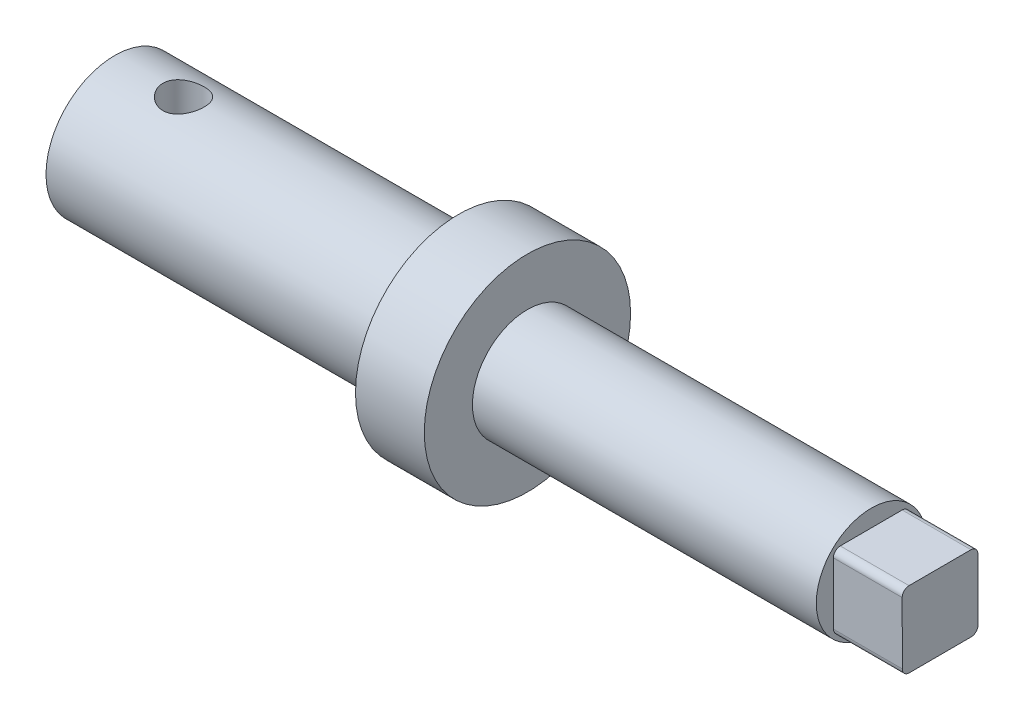
ISO-10303-21;
HEADER;
FILE_DESCRIPTION(('STEP AP214'),'2;1');
FILE_NAME('part.step','',(''),(''),'','','');
FILE_SCHEMA(('AUTOMOTIVE_DESIGN { 1 0 10303 214 1 1 1 1 }'));
ENDSEC;
DATA;
#1=APPLICATION_CONTEXT('core data for automotive mechanical design processes');
#2=APPLICATION_PROTOCOL_DEFINITION('international standard','automotive_design',2000,#1);
#3=PRODUCT_CONTEXT('',#1,'mechanical');
#4=PRODUCT('Part','Part','',(#3));
#5=PRODUCT_RELATED_PRODUCT_CATEGORY('part','',(#4));
#6=PRODUCT_DEFINITION_FORMATION('','',#4);
#7=PRODUCT_DEFINITION_CONTEXT('part definition',#1,'design');
#8=PRODUCT_DEFINITION('design','',#6,#7);
#9=PRODUCT_DEFINITION_SHAPE('','',#8);
#10=(LENGTH_UNIT() NAMED_UNIT(*) SI_UNIT(.MILLI.,.METRE.));
#11=(NAMED_UNIT(*) PLANE_ANGLE_UNIT() SI_UNIT($,.RADIAN.));
#12=(NAMED_UNIT(*) SI_UNIT($,.STERADIAN.) SOLID_ANGLE_UNIT());
#13=UNCERTAINTY_MEASURE_WITH_UNIT(LENGTH_MEASURE(1.E-05),#10,'distance_accuracy_value','');
#14=(GEOMETRIC_REPRESENTATION_CONTEXT(3) GLOBAL_UNCERTAINTY_ASSIGNED_CONTEXT((#13)) GLOBAL_UNIT_ASSIGNED_CONTEXT((#10,
#11,#12)) REPRESENTATION_CONTEXT('',''));
#15=CARTESIAN_POINT('',(0.,0.,0.));
#16=DIRECTION('',(0.,0.,1.));
#17=DIRECTION('',(1.,0.,0.));
#18=AXIS2_PLACEMENT_3D('',#15,#16,#17);
#19=CARTESIAN_POINT('',(55.,4.,0.));
#20=DIRECTION('',(-1.,0.,0.));
#21=DIRECTION('',(0.,0.,1.));
#22=AXIS2_PLACEMENT_3D('',#19,#20,#21);
#23=PLANE('',#22);
#24=CARTESIAN_POINT('',(55.,0.,0.));
#25=DIRECTION('',(-1.,0.,0.));
#26=DIRECTION('',(0.,0.,1.));
#27=AXIS2_PLACEMENT_3D('',#24,#25,#26);
#28=CIRCLE('',#27,4.);
#29=CARTESIAN_POINT('',(55.,0.,4.));
#30=VERTEX_POINT('',#29);
#31=EDGE_CURVE('E133',#30,#30,#28,.T.);
#32=ORIENTED_EDGE('',*,*,#31,.F.);
#33=EDGE_LOOP('',(#32));
#34=FACE_BOUND('',#33,.T.);
#35=DIRECTION('',(0.,-0.00265765345852937,0.999996468432811));
#36=VECTOR('',#35,1.);
#37=CARTESIAN_POINT('',(55.,2.75730857282167,-2.74269142717833));
#38=LINE('',#37,#36);
#39=CARTESIAN_POINT('',(55.,2.75597974609241,-2.24269319296192));
#40=VERTEX_POINT('',#39);
#41=CARTESIAN_POINT('',(55.,2.74402025390759,2.25731033860527));
#42=VERTEX_POINT('',#41);
#43=EDGE_CURVE('E115',#40,#42,#38,.T.);
#44=ORIENTED_EDGE('',*,*,#43,.F.);
#45=CARTESIAN_POINT('',(55.,2.255981511876,-2.24402201969119));
#46=DIRECTION('',(-1.,0.,0.));
#47=DIRECTION('',(0.,0.,1.));
#48=AXIS2_PLACEMENT_3D('',#45,#46,#47);
#49=CIRCLE('',#48,0.5);
#50=CARTESIAN_POINT('',(55.,2.25731033860527,-2.74402025390759));
#51=VERTEX_POINT('',#50);
#52=EDGE_CURVE('E99',#40,#51,#49,.T.);
#53=ORIENTED_EDGE('',*,*,#52,.T.);
#54=DIRECTION('',(0.,0.999996468432811,0.00265765345852969));
#55=VECTOR('',#54,1.);
#56=CARTESIAN_POINT('',(55.,-2.74269142717833,-2.75730857282167));
#57=LINE('',#56,#55);
#58=CARTESIAN_POINT('',(55.,-2.24269319296192,-2.75597974609241));
#59=VERTEX_POINT('',#58);
#60=EDGE_CURVE('E131',#59,#51,#57,.T.);
#61=ORIENTED_EDGE('',*,*,#60,.F.);
#62=CARTESIAN_POINT('',(55.,-2.24402201969119,-2.255981511876));
#63=DIRECTION('',(-1.,0.,0.));
#64=DIRECTION('',(0.,0.,1.));
#65=AXIS2_PLACEMENT_3D('',#62,#63,#64);
#66=CIRCLE('',#65,0.5);
#67=CARTESIAN_POINT('',(55.,-2.74402025390759,-2.25731033860527));
#68=VERTEX_POINT('',#67);
#69=EDGE_CURVE('E108',#59,#68,#66,.T.);
#70=ORIENTED_EDGE('',*,*,#69,.T.);
#71=DIRECTION('',(0.,0.00265765345852929,-0.999996468432811));
#72=VECTOR('',#71,1.);
#73=CARTESIAN_POINT('',(55.,-2.75730857282167,2.74269142717833));
#74=LINE('',#73,#72);
#75=CARTESIAN_POINT('',(55.,-2.75597974609241,2.24269319296192));
#76=VERTEX_POINT('',#75);
#77=EDGE_CURVE('E123',#76,#68,#74,.T.);
#78=ORIENTED_EDGE('',*,*,#77,.F.);
#79=CARTESIAN_POINT('',(55.,-2.255981511876,2.24402201969119));
#80=DIRECTION('',(-1.,0.,0.));
#81=DIRECTION('',(0.,0.,1.));
#82=AXIS2_PLACEMENT_3D('',#79,#80,#81);
#83=CIRCLE('',#82,0.5);
#84=CARTESIAN_POINT('',(55.,-2.25731033860527,2.74402025390759));
#85=VERTEX_POINT('',#84);
#86=EDGE_CURVE('E43',#76,#85,#83,.T.);
#87=ORIENTED_EDGE('',*,*,#86,.T.);
#88=DIRECTION('',(0.,-0.999996468432811,-0.00265765345852969));
#89=VECTOR('',#88,1.);
#90=CARTESIAN_POINT('',(55.,2.74269142717833,2.75730857282167));
#91=LINE('',#90,#89);
#92=CARTESIAN_POINT('',(55.,2.24269319296192,2.75597974609241));
#93=VERTEX_POINT('',#92);
#94=EDGE_CURVE('E121',#93,#85,#91,.T.);
#95=ORIENTED_EDGE('',*,*,#94,.F.);
#96=CARTESIAN_POINT('',(55.,2.24402201969119,2.255981511876));
#97=DIRECTION('',(-1.,0.,0.));
#98=DIRECTION('',(0.,0.,1.));
#99=AXIS2_PLACEMENT_3D('',#96,#97,#98);
#100=CIRCLE('',#99,0.5);
#101=EDGE_CURVE('E11',#93,#42,#100,.T.);
#102=ORIENTED_EDGE('',*,*,#101,.T.);
#103=EDGE_LOOP('',(#44,#53,#61,#70,#78,#87,#95,#102));
#104=FACE_BOUND('',#103,.T.);
#105=ADVANCED_FACE('F35',(#34,#104),#23,.F.);
#106=CARTESIAN_POINT('',(0.,0.,0.));
#107=DIRECTION('',(1.,0.,0.));
#108=DIRECTION('',(0.,0.,-1.));
#109=AXIS2_PLACEMENT_3D('',#106,#107,#108);
#110=PLANE('',#109);
#111=CARTESIAN_POINT('',(0.,0.,0.));
#112=DIRECTION('',(-1.,0.,0.));
#113=DIRECTION('',(0.,0.,1.));
#114=AXIS2_PLACEMENT_3D('',#111,#112,#113);
#115=CIRCLE('',#114,5.);
#116=CARTESIAN_POINT('',(0.,0.,5.));
#117=VERTEX_POINT('',#116);
#118=EDGE_CURVE('E148',#117,#117,#115,.T.);
#119=ORIENTED_EDGE('',*,*,#118,.T.);
#120=EDGE_LOOP('',(#119));
#121=FACE_BOUND('',#120,.T.);
#122=ADVANCED_FACE('F177',(#121),#110,.F.);
#123=CARTESIAN_POINT('',(0.,0.,0.));
#124=DIRECTION('',(-1.,0.,0.));
#125=DIRECTION('',(0.,0.,1.));
#126=AXIS2_PLACEMENT_3D('',#123,#124,#125);
#127=CYLINDRICAL_SURFACE('',#126,5.);
#128=CARTESIAN_POINT('',(3.5,-5.,0.));
#129=CARTESIAN_POINT('',(3.50000099748489,-4.9999992925055,0.0822886127533));
#130=CARTESIAN_POINT('',(3.50679386362397,-4.99794915693954,0.16458731835153));
#131=CARTESIAN_POINT('',(3.5337213542221,-4.98997105593691,0.326788125304881));
#132=CARTESIAN_POINT('',(3.55385995802334,-4.98404193389692,0.40668950441142));
#133=CARTESIAN_POINT('',(3.60674601691026,-4.96895552501836,0.561732707754527));
#134=CARTESIAN_POINT('',(3.63947486961894,-4.95980300250425,0.636881364395373));
#135=CARTESIAN_POINT('',(3.71653609305584,-4.93922109237645,0.780624181053132));
#136=CARTESIAN_POINT('',(3.76087000739542,-4.92779140192067,0.84921746746967));
#137=CARTESIAN_POINT('',(3.86122400747267,-4.90350737192774,0.979871797183745));
#138=CARTESIAN_POINT('',(3.91751662588591,-4.89062383657036,1.04171807124434));
#139=CARTESIAN_POINT('',(4.03960922991018,-4.86505834210442,1.15524920923324));
#140=CARTESIAN_POINT('',(4.10541081212496,-4.85237641724501,1.20693236327441));
#141=CARTESIAN_POINT('',(4.24647075303761,-4.82834113993772,1.29980037723708));
#142=CARTESIAN_POINT('',(4.32190846099074,-4.81702406663875,1.34072309022213));
#143=CARTESIAN_POINT('',(4.47898925423029,-4.79743620394031,1.4092139477476));
#144=CARTESIAN_POINT('',(4.56063084392798,-4.78916468313311,1.43678529919973));
#145=CARTESIAN_POINT('',(4.72539026613046,-4.77690870838434,1.47701633682652));
#146=CARTESIAN_POINT('',(4.80840274386394,-4.77281069324533,1.49007196234677));
#147=CARTESIAN_POINT('',(4.97553315621677,-4.76902789749767,1.50213730614672));
#148=CARTESIAN_POINT('',(5.05965081805909,-4.76934204760571,1.50115042761078));
#149=CARTESIAN_POINT('',(5.22338390860848,-4.77424744067778,1.48546977199812));
#150=CARTESIAN_POINT('',(5.30305225036224,-4.7786838859914,1.47127205262685));
#151=CARTESIAN_POINT('',(5.45881978627346,-4.79108356228624,1.43037420427056));
#152=CARTESIAN_POINT('',(5.53491862737433,-4.79904714132351,1.40367284141641));
#153=CARTESIAN_POINT('',(5.68260034966074,-4.81772733074973,1.33816026653682));
#154=CARTESIAN_POINT('',(5.75410708395526,-4.82848016115952,1.29918816934642));
#155=CARTESIAN_POINT('',(5.88973202201019,-4.85150987000065,1.21035222588683));
#156=CARTESIAN_POINT('',(5.95384842941378,-4.86378711746991,1.16048574002588));
#157=CARTESIAN_POINT('',(6.07568619076202,-4.88911011297937,1.04881290765546));
#158=CARTESIAN_POINT('',(6.13302866402967,-4.90216654310498,0.986594907466972));
#159=CARTESIAN_POINT('',(6.23655398406425,-4.92712244063259,0.853263259313967));
#160=CARTESIAN_POINT('',(6.28273612841443,-4.9390218351841,0.782149051860888));
#161=CARTESIAN_POINT('',(6.36285992246473,-4.9604316006947,0.632355038342803));
#162=CARTESIAN_POINT('',(6.39671751624986,-4.96992543668314,0.553627749747951));
#163=CARTESIAN_POINT('',(6.45059959009963,-4.98533521832222,0.39124541560352));
#164=CARTESIAN_POINT('',(6.47062792853249,-4.99125216186999,0.307591751589582));
#165=CARTESIAN_POINT('',(6.4956521778994,-4.99868364643538,0.140952242668332));
#166=CARTESIAN_POINT('',(6.50116158580161,-5.0003485041779,0.0580500976011876));
#167=CARTESIAN_POINT('',(6.49843084428792,-4.9995292324176,-0.107499605823383));
#168=CARTESIAN_POINT('',(6.49019253034856,-4.99704565677756,-0.190147196690781));
#169=CARTESIAN_POINT('',(6.46061538888851,-4.98830696987163,-0.350903605309697));
#170=CARTESIAN_POINT('',(6.43957661241913,-4.98213829799417,-0.429072772614169));
#171=CARTESIAN_POINT('',(6.3853567672218,-4.96674347841533,-0.580754638954522));
#172=CARTESIAN_POINT('',(6.35217423896214,-4.95751696321085,-0.654266777025584));
#173=CARTESIAN_POINT('',(6.27374683451887,-4.93669654351325,-0.796437189461053));
#174=CARTESIAN_POINT('',(6.22824065905203,-4.92505280829675,-0.86494382619967));
#175=CARTESIAN_POINT('',(6.12677524594719,-4.90073468764318,-0.993523307980148));
#176=CARTESIAN_POINT('',(6.07081338811233,-4.8880600443108,-1.05359403235594));
#177=CARTESIAN_POINT('',(5.94761269163066,-4.86253171869138,-1.16585744551027));
#178=CARTESIAN_POINT('',(5.88003812422826,-4.84968825033268,-1.21768481231503));
#179=CARTESIAN_POINT('',(5.73687206098647,-4.82576515238463,-1.30928995072154));
#180=CARTESIAN_POINT('',(5.66128077544179,-4.81468547654651,-1.34906803829472));
#181=CARTESIAN_POINT('',(5.50446750874531,-4.79567189615055,-1.41517347127168));
#182=CARTESIAN_POINT('',(5.42327381346341,-4.78772337843827,-1.4415634693705));
#183=CARTESIAN_POINT('',(5.25731203106852,-4.77591594362794,-1.48021730815114));
#184=CARTESIAN_POINT('',(5.17254517921233,-4.772055625083,-1.49248598978779));
#185=CARTESIAN_POINT('',(5.00563848162377,-4.76899972496087,-1.50221984485059));
#186=CARTESIAN_POINT('',(4.92353634898241,-4.76961647442754,-1.5002805530849));
#187=CARTESIAN_POINT('',(4.7608858966272,-4.77499401288294,-1.48307505444813));
#188=CARTESIAN_POINT('',(4.68033751482365,-4.77975463592551,-1.46780938124716));
#189=CARTESIAN_POINT('',(4.52405460085715,-4.79275763670386,-1.42476888804136));
#190=CARTESIAN_POINT('',(4.44827271263831,-4.80095604545965,-1.39715175507068));
#191=CARTESIAN_POINT('',(4.30235756118228,-4.81990278909136,-1.33031507121129));
#192=CARTESIAN_POINT('',(4.23222538235924,-4.83065161194312,-1.29109329962876));
#193=CARTESIAN_POINT('',(4.09683688347289,-4.85397676425833,-1.20048763805072));
#194=CARTESIAN_POINT('',(4.03185123873959,-4.86660540163798,-1.14871276092994));
#195=CARTESIAN_POINT('',(3.91129750169214,-4.89201320450026,-1.03517434629782));
#196=CARTESIAN_POINT('',(3.85573186053224,-4.90479240823905,-0.973408217134502));
#197=CARTESIAN_POINT('',(3.75397658770497,-4.92950936570649,-0.839465762183249));
#198=CARTESIAN_POINT('',(3.70810855314451,-4.94141159765674,-0.767037885790608));
#199=CARTESIAN_POINT('',(3.62926483009597,-4.96260680455813,-0.615141373983529));
#200=CARTESIAN_POINT('',(3.59628311172549,-4.97190099931067,-0.535676052998955));
#201=CARTESIAN_POINT('',(3.54710472434725,-4.98602174969301,-0.380757712655282));
#202=CARTESIAN_POINT('',(3.52948832711675,-4.99122027381068,-0.305786961954235));
#203=CARTESIAN_POINT('',(3.50593647475842,-4.99820944494492,-0.15388019523078));
#204=CARTESIAN_POINT('',(3.49999906729518,-5.0000006615474,-0.0769445098581397));
#205=CARTESIAN_POINT('',(3.5,-5.,0.));
#206=B_SPLINE_CURVE_WITH_KNOTS('',3,(#128,#129,#130,#131,#132,#133,#134,#135,#136,#137,#138,
#139,#140,#141,#142,#143,#144,#145,#146,#147,#148,#149,#150,#151,#152,#153,#154,#155,#156,#157,
#158,#159,#160,#161,#162,#163,#164,#165,#166,#167,#168,#169,#170,#171,#172,#173,#174,#175,#176,
#177,#178,#179,#180,#181,#182,#183,#184,#185,#186,#187,#188,#189,#190,#191,#192,#193,#194,#195,
#196,#197,#198,#199,#200,#201,#202,#203,#204,#205),.UNSPECIFIED.,.T.,.F.,(4,2,2,2,2,2,2,2,2,2,2,
2,2,2,2,2,2,2,2,2,2,2,2,2,2,2,2,2,2,2,2,2,2,2,2,2,2,2,4),(0.,0.246583203612611,0.493239964846,
0.739533676300875,0.985860164412702,1.23855602948192,1.49129437288633,1.74971481004109,
2.00807314543224,2.25919689356599,2.51025978319089,2.75226016697676,2.99428443658001,
3.2396242644712,3.48502360158556,3.74067104048167,3.99633456531072,4.25371046881689,
4.51101453528808,4.75908809438545,5.00712853550327,5.24956746682327,5.49203554593729,
5.74011305702908,5.98825282000191,6.24540400322818,6.50254844252681,6.75847814951252,
7.01432009460283,7.25950155466943,7.504673196616,7.74680040402721,7.98897397553107,
8.23996925679931,8.49102974897502,8.74942996156671,9.00770911595235,9.23831691930459,
9.46888616948874),.UNSPECIFIED.);
#207=CARTESIAN_POINT('',(3.5,-5.,0.));
#208=VERTEX_POINT('',#207);
#209=EDGE_CURVE('E158',#208,#208,#206,.T.);
#210=ORIENTED_EDGE('',*,*,#209,.T.);
#211=EDGE_LOOP('',(#210));
#212=FACE_BOUND('',#211,.T.);
#213=CARTESIAN_POINT('',(5.,4.76969600708473,1.5));
#214=CARTESIAN_POINT('',(4.9178054520576,4.7696968572698,1.49999897633764));
#215=CARTESIAN_POINT('',(4.83560077585598,4.77184390209069,1.49322108167142));
#216=CARTESIAN_POINT('',(4.67359475040806,4.780165783029,1.46635844446749));
#217=CARTESIAN_POINT('',(4.59379421349854,4.78634196493468,1.44626925573578));
#218=CARTESIAN_POINT('',(4.43896527172827,4.80196102485632,1.39352753269955));
#219=CARTESIAN_POINT('',(4.36392917036691,4.81139846703232,1.36089589394243));
#220=CARTESIAN_POINT('',(4.2203780660047,4.83246932547567,1.28406421917929));
#221=CARTESIAN_POINT('',(4.15186404131556,4.84410307041019,1.23986245137053));
#222=CARTESIAN_POINT('',(4.02113360942262,4.86866862185765,1.13964754141627));
#223=CARTESIAN_POINT('',(3.95915410205371,4.88162808311636,1.08333207175807));
#224=CARTESIAN_POINT('',(3.84536204867749,4.90714861936757,0.961136237579599));
#225=CARTESIAN_POINT('',(3.79355080955012,4.91970964297705,0.895254645461112));
#226=CARTESIAN_POINT('',(3.70053730016669,4.94333214579389,0.75411143779369));
#227=CARTESIAN_POINT('',(3.65957657555719,4.95435724342404,0.678684021335815));
#228=CARTESIAN_POINT('',(3.59101274095724,4.97334435920684,0.521624645369354));
#229=CARTESIAN_POINT('',(3.56340675014255,4.98130703789495,0.439994028387912));
#230=CARTESIAN_POINT('',(3.52311999890949,4.99307646003589,0.275323852630829));
#231=CARTESIAN_POINT('',(3.5100348723473,4.99699557369338,0.192391398953801));
#232=CARTESIAN_POINT('',(3.49788267535356,5.00063201501348,0.0254218237493149));
#233=CARTESIAN_POINT('',(3.49881266059804,5.00035022521079,-0.0586150620503684));
#234=CARTESIAN_POINT('',(3.51439286854302,4.99569603817659,-0.22257115660016));
#235=CARTESIAN_POINT('',(3.52860519380987,4.9914542020526,-0.302536267641342));
#236=CARTESIAN_POINT('',(3.56963133599429,4.97951522112593,-0.458889213442527));
#237=CARTESIAN_POINT('',(3.59644595094267,4.97181785750586,-0.535276821322846));
#238=CARTESIAN_POINT('',(3.66221202341856,4.95365220986963,-0.683347326351281));
#239=CARTESIAN_POINT('',(3.70130120280727,4.94315269676706,-0.754965064694478));
#240=CARTESIAN_POINT('',(3.79039785242823,4.92049640648069,-0.890764673783156));
#241=CARTESIAN_POINT('',(3.84040791296348,4.90833923637778,-0.954944774872131));
#242=CARTESIAN_POINT('',(3.9521977507516,4.88311550488165,-1.0766604815298));
#243=CARTESIAN_POINT('',(4.01435691902974,4.87003195321461,-1.13384458040112));
#244=CARTESIAN_POINT('',(4.14751001789005,4.84483979887497,-1.23707651539824));
#245=CARTESIAN_POINT('',(4.21850482538923,4.8327312931702,-1.28312324482853));
#246=CARTESIAN_POINT('',(4.36823946924899,4.81077903197678,-1.3631399533545));
#247=CARTESIAN_POINT('',(4.44704704586292,4.80095810695957,-1.39698989237679));
#248=CARTESIAN_POINT('',(4.60960720844554,4.78496392548436,-1.45083362878413));
#249=CARTESIAN_POINT('',(4.69335817153456,4.7787894791583,-1.4708319464056));
#250=CARTESIAN_POINT('',(4.86008236073928,4.77104849541241,-1.49574770282165));
#251=CARTESIAN_POINT('',(4.94296822389398,4.7693187867044,-1.50119946380212));
#252=CARTESIAN_POINT('',(5.10847290000987,4.77021192441924,-1.49835947233062));
#253=CARTESIAN_POINT('',(5.19109174873085,4.77283416156589,-1.4900696437133));
#254=CARTESIAN_POINT('',(5.35148837797087,4.78197558554912,-1.4604576357419));
#255=CARTESIAN_POINT('',(5.42933616426352,4.78839176507489,-1.4394796143128));
#256=CARTESIAN_POINT('',(5.58040169081492,4.80429141231227,-1.3854857774794));
#257=CARTESIAN_POINT('',(5.65361871414057,4.81377535359073,-1.3524681034276));
#258=CARTESIAN_POINT('',(5.79551746407213,4.83505835023047,-1.274318711965));
#259=CARTESIAN_POINT('',(5.86402472098579,4.84691271069799,-1.22888564172729));
#260=CARTESIAN_POINT('',(5.9926381061808,4.87148205646987,-1.12755301600385));
#261=CARTESIAN_POINT('',(6.05274221761279,4.88419724730003,-1.07165095534897));
#262=CARTESIAN_POINT('',(6.16518040581474,4.90963633548158,-0.948455132493599));
#263=CARTESIAN_POINT('',(6.21713562898698,4.92234245063004,-0.880811065857435));
#264=CARTESIAN_POINT('',(6.30896670102775,4.94584851748651,-0.737461784590249));
#265=CARTESIAN_POINT('',(6.34884314978146,4.95664856384717,-0.661756970543944));
#266=CARTESIAN_POINT('',(6.4150000305683,4.97505970474957,-0.504935504705222));
#267=CARTESIAN_POINT('',(6.44138201615898,4.98269453424966,-0.423864622037839));
#268=CARTESIAN_POINT('',(6.48006091889042,4.99401979596827,-0.258169966504589));
#269=CARTESIAN_POINT('',(6.49236186594842,4.9977113567088,-0.173547217354763));
#270=CARTESIAN_POINT('',(6.5022230440545,5.00066544081399,-0.00665215388274325));
#271=CARTESIAN_POINT('',(6.50033269540783,5.00009305111322,0.0755851790862062));
#272=CARTESIAN_POINT('',(6.48317836750088,4.99497264465037,0.238519481164403));
#273=CARTESIAN_POINT('',(6.46791514651956,4.99042485330463,0.319216537346528));
#274=CARTESIAN_POINT('',(6.42478833860038,4.97791168358327,0.475935813041358));
#275=CARTESIAN_POINT('',(6.39706181935099,4.96998352900866,0.551998927351392));
#276=CARTESIAN_POINT('',(6.32991808549281,4.9515294303945,0.698433237752053));
#277=CARTESIAN_POINT('',(6.29049894971381,4.94100305949946,0.76880349605058));
#278=CARTESIAN_POINT('',(6.19962654256996,4.91803965828228,0.904301892420563));
#279=CARTESIAN_POINT('',(6.14782856999923,4.90555226923559,0.969190250076768));
#280=CARTESIAN_POINT('',(6.0342896116672,4.88023537212334,1.08953757134595));
#281=CARTESIAN_POINT('',(5.97254576210185,4.86740576641079,1.14499380960194));
#282=CARTESIAN_POINT('',(5.83865922168949,4.84240680631319,1.24656269394549));
#283=CARTESIAN_POINT('',(5.76626144660956,4.83026852693485,1.29234759757956));
#284=CARTESIAN_POINT('',(5.61444482583898,4.80852547508793,1.37104313528776));
#285=CARTESIAN_POINT('',(5.53502937639881,4.79891948596955,1.40395995557289));
#286=CARTESIAN_POINT('',(5.38025956839373,4.78427816717595,1.4530194253295));
#287=CARTESIAN_POINT('',(5.30539135306901,4.7788615484052,1.47058859011232));
#288=CARTESIAN_POINT('',(5.15368477750423,4.77157042597167,1.49407818835144));
#289=CARTESIAN_POINT('',(5.07684681535475,4.7696952122143,1.50000095706095));
#290=CARTESIAN_POINT('',(5.,4.76969600708473,1.5));
#291=B_SPLINE_CURVE_WITH_KNOTS('',3,(#213,#214,#215,#216,#217,#218,#219,#220,#221,#222,#223,
#224,#225,#226,#227,#228,#229,#230,#231,#232,#233,#234,#235,#236,#237,#238,#239,#240,#241,#242,
#243,#244,#245,#246,#247,#248,#249,#250,#251,#252,#253,#254,#255,#256,#257,#258,#259,#260,#261,
#262,#263,#264,#265,#266,#267,#268,#269,#270,#271,#272,#273,#274,#275,#276,#277,#278,#279,#280,
#281,#282,#283,#284,#285,#286,#287,#288,#289,#290),.UNSPECIFIED.,.T.,.F.,(4,2,2,2,2,2,2,2,2,2,2,
2,2,2,2,2,2,2,2,2,2,2,2,2,2,2,2,2,2,2,2,2,2,2,2,2,2,2,4),(0.,0.246300165915543,0.492682641689,
0.738656414466193,0.984667025370101,1.23773150007984,1.49082847871273,1.74915939273645,
2.00743455587877,2.25832140149558,2.5091555410144,2.7520012599088,2.99486235890376,
3.24055209335676,3.48630016590831,3.74152147023278,3.99676812491863,4.25446238246267,
4.51207250628411,4.76008080790309,5.00805439107388,5.24958594938817,5.49115481045788,
5.73920731809389,5.98731925928923,6.24479506100602,6.50225807324202,6.75775391814325,
7.01317662321682,7.2587630391122,7.50433553047755,7.74727096872219,7.99024634491379,
8.24099627054489,8.49181852629891,8.75011639669147,9.00828993963945,9.23861153857448,
9.46888695033561),.UNSPECIFIED.);
#292=CARTESIAN_POINT('',(5.,4.76969600708473,1.5));
#293=VERTEX_POINT('',#292);
#294=EDGE_CURVE('E151',#293,#293,#291,.T.);
#295=ORIENTED_EDGE('',*,*,#294,.T.);
#296=EDGE_LOOP('',(#295));
#297=FACE_BOUND('',#296,.T.);
#298=ORIENTED_EDGE('',*,*,#118,.F.);
#299=EDGE_LOOP('',(#298));
#300=FACE_BOUND('',#299,.T.);
#301=CARTESIAN_POINT('',(25.,0.,0.));
#302=DIRECTION('',(-1.,0.,0.));
#303=DIRECTION('',(0.,0.,1.));
#304=AXIS2_PLACEMENT_3D('',#301,#302,#303);
#305=CIRCLE('',#304,5.);
#306=CARTESIAN_POINT('',(25.,0.,5.));
#307=VERTEX_POINT('',#306);
#308=EDGE_CURVE('E145',#307,#307,#305,.T.);
#309=ORIENTED_EDGE('',*,*,#308,.T.);
#310=EDGE_LOOP('',(#309));
#311=FACE_BOUND('',#310,.T.);
#312=ADVANCED_FACE('F162',(#212,#297,#300,#311),#127,.T.);
#313=CARTESIAN_POINT('',(25.,5.,0.));
#314=DIRECTION('',(1.,0.,0.));
#315=DIRECTION('',(0.,0.,-1.));
#316=AXIS2_PLACEMENT_3D('',#313,#314,#315);
#317=PLANE('',#316);
#318=ORIENTED_EDGE('',*,*,#308,.F.);
#319=EDGE_LOOP('',(#318));
#320=FACE_BOUND('',#319,.T.);
#321=CARTESIAN_POINT('',(25.,0.,0.));
#322=DIRECTION('',(-1.,0.,0.));
#323=DIRECTION('',(0.,0.,1.));
#324=AXIS2_PLACEMENT_3D('',#321,#322,#323);
#325=CIRCLE('',#324,7.5);
#326=CARTESIAN_POINT('',(25.,0.,7.5));
#327=VERTEX_POINT('',#326);
#328=EDGE_CURVE('E142',#327,#327,#325,.T.);
#329=ORIENTED_EDGE('',*,*,#328,.T.);
#330=EDGE_LOOP('',(#329));
#331=FACE_BOUND('',#330,.T.);
#332=ADVANCED_FACE('F188',(#320,#331),#317,.F.);
#333=CARTESIAN_POINT('',(0.,0.,0.));
#334=DIRECTION('',(-1.,0.,0.));
#335=DIRECTION('',(0.,0.,1.));
#336=AXIS2_PLACEMENT_3D('',#333,#334,#335);
#337=CYLINDRICAL_SURFACE('',#336,7.5);
#338=ORIENTED_EDGE('',*,*,#328,.F.);
#339=EDGE_LOOP('',(#338));
#340=FACE_BOUND('',#339,.T.);
#341=CARTESIAN_POINT('',(30.,0.,0.));
#342=DIRECTION('',(-1.,0.,0.));
#343=DIRECTION('',(0.,0.,1.));
#344=AXIS2_PLACEMENT_3D('',#341,#342,#343);
#345=CIRCLE('',#344,7.5);
#346=CARTESIAN_POINT('',(30.,0.,7.5));
#347=VERTEX_POINT('',#346);
#348=EDGE_CURVE('E139',#347,#347,#345,.T.);
#349=ORIENTED_EDGE('',*,*,#348,.T.);
#350=EDGE_LOOP('',(#349));
#351=FACE_BOUND('',#350,.T.);
#352=ADVANCED_FACE('F185',(#340,#351),#337,.T.);
#353=CARTESIAN_POINT('',(30.,7.5,0.));
#354=DIRECTION('',(-1.,0.,0.));
#355=DIRECTION('',(0.,0.,1.));
#356=AXIS2_PLACEMENT_3D('',#353,#354,#355);
#357=PLANE('',#356);
#358=ORIENTED_EDGE('',*,*,#348,.F.);
#359=EDGE_LOOP('',(#358));
#360=FACE_BOUND('',#359,.T.);
#361=CARTESIAN_POINT('',(30.,0.,0.));
#362=DIRECTION('',(-1.,0.,0.));
#363=DIRECTION('',(0.,0.,1.));
#364=AXIS2_PLACEMENT_3D('',#361,#362,#363);
#365=CIRCLE('',#364,4.);
#366=CARTESIAN_POINT('',(30.,0.,4.));
#367=VERTEX_POINT('',#366);
#368=EDGE_CURVE('E136',#367,#367,#365,.T.);
#369=ORIENTED_EDGE('',*,*,#368,.T.);
#370=EDGE_LOOP('',(#369));
#371=FACE_BOUND('',#370,.T.);
#372=ADVANCED_FACE('F181',(#360,#371),#357,.F.);
#373=CARTESIAN_POINT('',(0.,0.,0.));
#374=DIRECTION('',(-1.,0.,0.));
#375=DIRECTION('',(0.,0.,1.));
#376=AXIS2_PLACEMENT_3D('',#373,#374,#375);
#377=CYLINDRICAL_SURFACE('',#376,4.);
#378=ORIENTED_EDGE('',*,*,#368,.F.);
#379=EDGE_LOOP('',(#378));
#380=FACE_BOUND('',#379,.T.);
#381=ORIENTED_EDGE('',*,*,#31,.T.);
#382=EDGE_LOOP('',(#381));
#383=FACE_BOUND('',#382,.T.);
#384=ADVANCED_FACE('F171',(#380,#383),#377,.T.);
#385=CARTESIAN_POINT('',(5.,-5.,0.));
#386=DIRECTION('',(0.,1.,0.));
#387=DIRECTION('',(0.,0.,1.));
#388=AXIS2_PLACEMENT_3D('',#385,#386,#387);
#389=CYLINDRICAL_SURFACE('',#388,1.5);
#390=ORIENTED_EDGE('',*,*,#294,.F.);
#391=EDGE_LOOP('',(#390));
#392=FACE_BOUND('',#391,.T.);
#393=ORIENTED_EDGE('',*,*,#209,.F.);
#394=EDGE_LOOP('',(#393));
#395=FACE_BOUND('',#394,.T.);
#396=ADVANCED_FACE('F166',(#392,#395),#389,.F.);
#397=CARTESIAN_POINT('',(60.,2.75730857282167,-2.74269142717833));
#398=DIRECTION('',(0.,-0.999996468432811,-0.00265765345852937));
#399=DIRECTION('',(0.,0.00265765345852937,-0.999996468432811));
#400=AXIS2_PLACEMENT_3D('',#397,#398,#399);
#401=PLANE('',#400);
#402=DIRECTION('',(0.,-0.00265765345852937,0.999996468432811));
#403=VECTOR('',#402,1.);
#404=CARTESIAN_POINT('',(60.,2.75730857282167,-2.74269142717833));
#405=LINE('',#404,#403);
#406=CARTESIAN_POINT('',(60.,2.75597974609241,-2.24269319296192));
#407=VERTEX_POINT('',#406);
#408=CARTESIAN_POINT('',(60.,2.74402025390759,2.25731033860527));
#409=VERTEX_POINT('',#408);
#410=EDGE_CURVE('E117',#407,#409,#405,.T.);
#411=ORIENTED_EDGE('',*,*,#410,.F.);
#412=DIRECTION('',(-1.,0.,0.));
#413=VECTOR('',#412,1.);
#414=CARTESIAN_POINT('',(60.,2.75597974609241,-2.24269319296192));
#415=LINE('',#414,#413);
#416=EDGE_CURVE('E103',#407,#40,#415,.T.);
#417=ORIENTED_EDGE('',*,*,#416,.T.);
#418=ORIENTED_EDGE('',*,*,#43,.T.);
#419=DIRECTION('',(-1.,0.,0.));
#420=VECTOR('',#419,1.);
#421=CARTESIAN_POINT('',(60.,2.74402025390759,2.25731033860527));
#422=LINE('',#421,#420);
#423=EDGE_CURVE('E119',#42,#409,#422,.F.);
#424=ORIENTED_EDGE('',*,*,#423,.T.);
#425=EDGE_LOOP('',(#411,#417,#418,#424));
#426=FACE_BOUND('',#425,.T.);
#427=ADVANCED_FACE('F114',(#426),#401,.F.);
#428=CARTESIAN_POINT('',(60.,2.74269142717833,2.75730857282167));
#429=DIRECTION('',(0.,0.00265765345852969,-0.999996468432811));
#430=DIRECTION('',(0.,0.999996468432811,0.00265765345852969));
#431=AXIS2_PLACEMENT_3D('',#428,#429,#430);
#432=PLANE('',#431);
#433=ORIENTED_EDGE('',*,*,#94,.T.);
#434=DIRECTION('',(-1.,0.,0.));
#435=VECTOR('',#434,1.);
#436=CARTESIAN_POINT('',(60.,-2.25731033860527,2.74402025390759));
#437=LINE('',#436,#435);
#438=CARTESIAN_POINT('',(60.,-2.25731033860527,2.74402025390759));
#439=VERTEX_POINT('',#438);
#440=EDGE_CURVE('E109',#85,#439,#437,.F.);
#441=ORIENTED_EDGE('',*,*,#440,.T.);
#442=DIRECTION('',(0.,-0.999996468432811,-0.00265765345852969));
#443=VECTOR('',#442,1.);
#444=CARTESIAN_POINT('',(60.,2.74269142717833,2.75730857282167));
#445=LINE('',#444,#443);
#446=CARTESIAN_POINT('',(60.,2.24269319296192,2.75597974609241));
#447=VERTEX_POINT('',#446);
#448=EDGE_CURVE('E254',#447,#439,#445,.T.);
#449=ORIENTED_EDGE('',*,*,#448,.F.);
#450=DIRECTION('',(-1.,0.,0.));
#451=VECTOR('',#450,1.);
#452=CARTESIAN_POINT('',(60.,2.24269319296192,2.75597974609241));
#453=LINE('',#452,#451);
#454=EDGE_CURVE('E234',#447,#93,#453,.T.);
#455=ORIENTED_EDGE('',*,*,#454,.T.);
#456=EDGE_LOOP('',(#433,#441,#449,#455));
#457=FACE_BOUND('',#456,.T.);
#458=ADVANCED_FACE('F261',(#457),#432,.F.);
#459=CARTESIAN_POINT('',(60.,-2.75730857282167,2.74269142717833));
#460=DIRECTION('',(0.,0.999996468432811,0.00265765345852929));
#461=DIRECTION('',(0.,-0.00265765345852929,0.999996468432811));
#462=AXIS2_PLACEMENT_3D('',#459,#460,#461);
#463=PLANE('',#462);
#464=ORIENTED_EDGE('',*,*,#77,.T.);
#465=DIRECTION('',(-1.,0.,0.));
#466=VECTOR('',#465,1.);
#467=CARTESIAN_POINT('',(60.,-2.74402025390759,-2.25731033860527));
#468=LINE('',#467,#466);
#469=CARTESIAN_POINT('',(60.,-2.74402025390759,-2.25731033860527));
#470=VERTEX_POINT('',#469);
#471=EDGE_CURVE('E232',#68,#470,#468,.F.);
#472=ORIENTED_EDGE('',*,*,#471,.T.);
#473=DIRECTION('',(0.,0.00265765345852929,-0.999996468432811));
#474=VECTOR('',#473,1.);
#475=CARTESIAN_POINT('',(60.,-2.75730857282167,2.74269142717833));
#476=LINE('',#475,#474);
#477=CARTESIAN_POINT('',(60.,-2.75597974609241,2.24269319296192));
#478=VERTEX_POINT('',#477);
#479=EDGE_CURVE('E251',#478,#470,#476,.T.);
#480=ORIENTED_EDGE('',*,*,#479,.F.);
#481=DIRECTION('',(-1.,0.,0.));
#482=VECTOR('',#481,1.);
#483=CARTESIAN_POINT('',(60.,-2.75597974609241,2.24269319296192));
#484=LINE('',#483,#482);
#485=EDGE_CURVE('E229',#478,#76,#484,.T.);
#486=ORIENTED_EDGE('',*,*,#485,.T.);
#487=EDGE_LOOP('',(#464,#472,#480,#486));
#488=FACE_BOUND('',#487,.T.);
#489=ADVANCED_FACE('F241',(#488),#463,.F.);
#490=CARTESIAN_POINT('',(60.,-2.74269142717833,-2.75730857282167));
#491=DIRECTION('',(0.,-0.00265765345852969,0.999996468432811));
#492=DIRECTION('',(0.,-0.999996468432811,-0.00265765345852969));
#493=AXIS2_PLACEMENT_3D('',#490,#491,#492);
#494=PLANE('',#493);
#495=ORIENTED_EDGE('',*,*,#60,.T.);
#496=DIRECTION('',(-1.,0.,0.));
#497=VECTOR('',#496,1.);
#498=CARTESIAN_POINT('',(60.,2.25731033860527,-2.74402025390759));
#499=LINE('',#498,#497);
#500=CARTESIAN_POINT('',(60.,2.25731033860527,-2.74402025390759));
#501=VERTEX_POINT('',#500);
#502=EDGE_CURVE('E104',#51,#501,#499,.F.);
#503=ORIENTED_EDGE('',*,*,#502,.T.);
#504=DIRECTION('',(0.,0.999996468432811,0.00265765345852969));
#505=VECTOR('',#504,1.);
#506=CARTESIAN_POINT('',(60.,-2.74269142717833,-2.75730857282167));
#507=LINE('',#506,#505);
#508=CARTESIAN_POINT('',(60.,-2.24269319296192,-2.75597974609241));
#509=VERTEX_POINT('',#508);
#510=EDGE_CURVE('E126',#509,#501,#507,.T.);
#511=ORIENTED_EDGE('',*,*,#510,.F.);
#512=DIRECTION('',(-1.,0.,0.));
#513=VECTOR('',#512,1.);
#514=CARTESIAN_POINT('',(60.,-2.24269319296192,-2.75597974609241));
#515=LINE('',#514,#513);
#516=EDGE_CURVE('E118',#509,#59,#515,.T.);
#517=ORIENTED_EDGE('',*,*,#516,.T.);
#518=EDGE_LOOP('',(#495,#503,#511,#517));
#519=FACE_BOUND('',#518,.T.);
#520=ADVANCED_FACE('F253',(#519),#494,.F.);
#521=CARTESIAN_POINT('',(60.,0.,0.));
#522=DIRECTION('',(1.,0.,0.));
#523=DIRECTION('',(0.,0.,-1.));
#524=AXIS2_PLACEMENT_3D('',#521,#522,#523);
#525=PLANE('',#524);
#526=ORIENTED_EDGE('',*,*,#510,.T.);
#527=CARTESIAN_POINT('',(60.,2.255981511876,-2.24402201969119));
#528=DIRECTION('',(1.,0.,0.));
#529=DIRECTION('',(0.,0.,-1.));
#530=AXIS2_PLACEMENT_3D('',#527,#528,#529);
#531=CIRCLE('',#530,0.5);
#532=EDGE_CURVE('E227',#501,#407,#531,.T.);
#533=ORIENTED_EDGE('',*,*,#532,.T.);
#534=ORIENTED_EDGE('',*,*,#410,.T.);
#535=CARTESIAN_POINT('',(60.,2.24402201969119,2.255981511876));
#536=DIRECTION('',(1.,0.,0.));
#537=DIRECTION('',(0.,0.,-1.));
#538=AXIS2_PLACEMENT_3D('',#535,#536,#537);
#539=CIRCLE('',#538,0.5);
#540=EDGE_CURVE('E221',#409,#447,#539,.T.);
#541=ORIENTED_EDGE('',*,*,#540,.T.);
#542=ORIENTED_EDGE('',*,*,#448,.T.);
#543=CARTESIAN_POINT('',(60.,-2.255981511876,2.24402201969119));
#544=DIRECTION('',(1.,0.,0.));
#545=DIRECTION('',(0.,0.,-1.));
#546=AXIS2_PLACEMENT_3D('',#543,#544,#545);
#547=CIRCLE('',#546,0.5);
#548=EDGE_CURVE('E223',#439,#478,#547,.T.);
#549=ORIENTED_EDGE('',*,*,#548,.T.);
#550=ORIENTED_EDGE('',*,*,#479,.T.);
#551=CARTESIAN_POINT('',(60.,-2.24402201969119,-2.255981511876));
#552=DIRECTION('',(1.,0.,0.));
#553=DIRECTION('',(0.,0.,-1.));
#554=AXIS2_PLACEMENT_3D('',#551,#552,#553);
#555=CIRCLE('',#554,0.5);
#556=EDGE_CURVE('E225',#470,#509,#555,.T.);
#557=ORIENTED_EDGE('',*,*,#556,.T.);
#558=EDGE_LOOP('',(#526,#533,#534,#541,#542,#549,#550,#557));
#559=FACE_BOUND('',#558,.T.);
#560=ADVANCED_FACE('F250',(#559),#525,.T.);
#561=CARTESIAN_POINT('',(60.,2.255981511876,-2.24402201969119));
#562=DIRECTION('',(-1.,0.,0.));
#563=DIRECTION('',(0.,0.,1.));
#564=AXIS2_PLACEMENT_3D('',#561,#562,#563);
#565=CYLINDRICAL_SURFACE('',#564,0.5);
#566=ORIENTED_EDGE('',*,*,#532,.F.);
#567=ORIENTED_EDGE('',*,*,#502,.F.);
#568=ORIENTED_EDGE('',*,*,#52,.F.);
#569=ORIENTED_EDGE('',*,*,#416,.F.);
#570=EDGE_LOOP('',(#566,#567,#568,#569));
#571=FACE_BOUND('',#570,.T.);
#572=ADVANCED_FACE('F102',(#571),#565,.T.);
#573=CARTESIAN_POINT('',(60.,-2.24402201969119,-2.255981511876));
#574=DIRECTION('',(-1.,0.,0.));
#575=DIRECTION('',(0.,0.,1.));
#576=AXIS2_PLACEMENT_3D('',#573,#574,#575);
#577=CYLINDRICAL_SURFACE('',#576,0.5);
#578=ORIENTED_EDGE('',*,*,#556,.F.);
#579=ORIENTED_EDGE('',*,*,#471,.F.);
#580=ORIENTED_EDGE('',*,*,#69,.F.);
#581=ORIENTED_EDGE('',*,*,#516,.F.);
#582=EDGE_LOOP('',(#578,#579,#580,#581));
#583=FACE_BOUND('',#582,.T.);
#584=ADVANCED_FACE('F246',(#583),#577,.T.);
#585=CARTESIAN_POINT('',(60.,-2.255981511876,2.24402201969119));
#586=DIRECTION('',(-1.,0.,0.));
#587=DIRECTION('',(0.,0.,1.));
#588=AXIS2_PLACEMENT_3D('',#585,#586,#587);
#589=CYLINDRICAL_SURFACE('',#588,0.5);
#590=ORIENTED_EDGE('',*,*,#548,.F.);
#591=ORIENTED_EDGE('',*,*,#440,.F.);
#592=ORIENTED_EDGE('',*,*,#86,.F.);
#593=ORIENTED_EDGE('',*,*,#485,.F.);
#594=EDGE_LOOP('',(#590,#591,#592,#593));
#595=FACE_BOUND('',#594,.T.);
#596=ADVANCED_FACE('F265',(#595),#589,.T.);
#597=CARTESIAN_POINT('',(60.,2.24402201969119,2.255981511876));
#598=DIRECTION('',(-1.,0.,0.));
#599=DIRECTION('',(0.,0.,1.));
#600=AXIS2_PLACEMENT_3D('',#597,#598,#599);
#601=CYLINDRICAL_SURFACE('',#600,0.5);
#602=ORIENTED_EDGE('',*,*,#540,.F.);
#603=ORIENTED_EDGE('',*,*,#423,.F.);
#604=ORIENTED_EDGE('',*,*,#101,.F.);
#605=ORIENTED_EDGE('',*,*,#454,.F.);
#606=EDGE_LOOP('',(#602,#603,#604,#605));
#607=FACE_BOUND('',#606,.T.);
#608=ADVANCED_FACE('F37',(#607),#601,.T.);
#609=CLOSED_SHELL('',(#105,#122,#312,#332,#352,#372,#384,#396,#427,#458,#489,#520,#560,#572,
#584,#596,#608));
#610=MANIFOLD_SOLID_BREP('B2',#609);
#611=ADVANCED_BREP_SHAPE_REPRESENTATION('',(#18,#610),#14);
#612=SHAPE_DEFINITION_REPRESENTATION(#9,#611);
ENDSEC;
END-ISO-10303-21;
